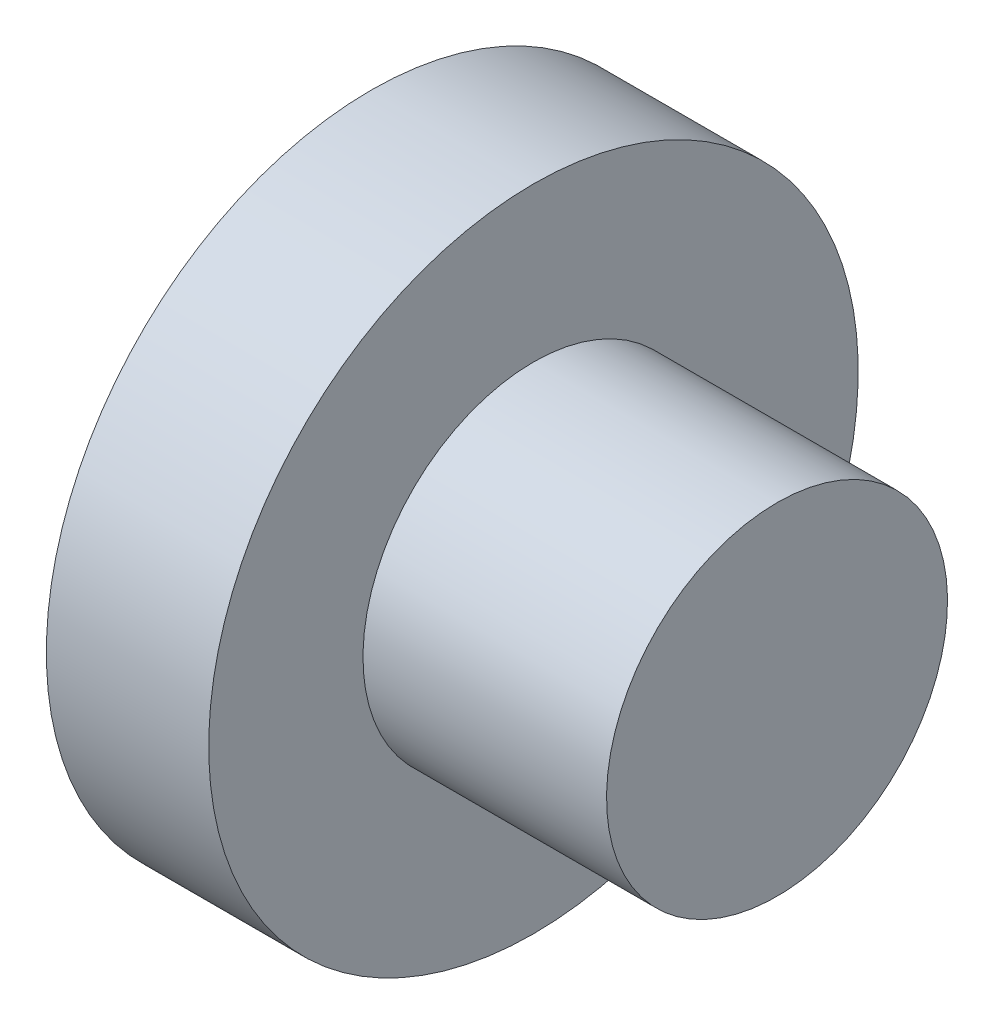
ISO-10303-21;
HEADER;
FILE_DESCRIPTION(('STEP AP214'),'2;1');
FILE_NAME('part.step','',(''),(''),'','','');
FILE_SCHEMA(('AUTOMOTIVE_DESIGN { 1 0 10303 214 1 1 1 1 }'));
ENDSEC;
DATA;
#1=APPLICATION_CONTEXT('core data for automotive mechanical design processes');
#2=APPLICATION_PROTOCOL_DEFINITION('international standard','automotive_design',2000,#1);
#3=PRODUCT_CONTEXT('',#1,'mechanical');
#4=PRODUCT('Part','Part','',(#3));
#5=PRODUCT_RELATED_PRODUCT_CATEGORY('part','',(#4));
#6=PRODUCT_DEFINITION_FORMATION('','',#4);
#7=PRODUCT_DEFINITION_CONTEXT('part definition',#1,'design');
#8=PRODUCT_DEFINITION('design','',#6,#7);
#9=PRODUCT_DEFINITION_SHAPE('','',#8);
#10=(LENGTH_UNIT() NAMED_UNIT(*) SI_UNIT(.MILLI.,.METRE.));
#11=(NAMED_UNIT(*) PLANE_ANGLE_UNIT() SI_UNIT($,.RADIAN.));
#12=(NAMED_UNIT(*) SI_UNIT($,.STERADIAN.) SOLID_ANGLE_UNIT());
#13=UNCERTAINTY_MEASURE_WITH_UNIT(LENGTH_MEASURE(1.E-05),#10,'distance_accuracy_value','');
#14=(GEOMETRIC_REPRESENTATION_CONTEXT(3) GLOBAL_UNCERTAINTY_ASSIGNED_CONTEXT((#13)) GLOBAL_UNIT_ASSIGNED_CONTEXT((#10,
#11,#12)) REPRESENTATION_CONTEXT('',''));
#15=CARTESIAN_POINT('',(0.,0.,0.));
#16=DIRECTION('',(0.,0.,1.));
#17=DIRECTION('',(1.,0.,0.));
#18=AXIS2_PLACEMENT_3D('',#15,#16,#17);
#19=CARTESIAN_POINT('',(2.,2.5,0.));
#20=DIRECTION('',(-1.,0.,0.));
#21=DIRECTION('',(0.,-1.,0.));
#22=AXIS2_PLACEMENT_3D('',#19,#20,#21);
#23=PLANE('',#22);
#24=CARTESIAN_POINT('',(2.,0.,0.));
#25=DIRECTION('',(1.,0.,0.));
#26=DIRECTION('',(0.,1.,0.));
#27=AXIS2_PLACEMENT_3D('',#24,#25,#26);
#28=CIRCLE('',#27,2.5);
#29=CARTESIAN_POINT('',(2.,2.5,0.));
#30=VERTEX_POINT('',#29);
#31=EDGE_CURVE('E18',#30,#30,#28,.F.);
#32=ORIENTED_EDGE('',*,*,#31,.T.);
#33=EDGE_LOOP('',(#32));
#34=FACE_BOUND('',#33,.T.);
#35=ADVANCED_FACE('F15',(#34),#23,.T.);
#36=CARTESIAN_POINT('',(1.5,0.,0.));
#37=DIRECTION('',(1.,0.,0.));
#38=DIRECTION('',(0.,1.,0.));
#39=AXIS2_PLACEMENT_3D('',#36,#37,#38);
#40=CYLINDRICAL_SURFACE('',#39,2.5);
#41=ORIENTED_EDGE('',*,*,#31,.F.);
#42=EDGE_LOOP('',(#41));
#43=FACE_BOUND('',#42,.T.);
#44=CARTESIAN_POINT('',(1.,0.,0.));
#45=DIRECTION('',(1.,0.,0.));
#46=DIRECTION('',(0.,1.,0.));
#47=AXIS2_PLACEMENT_3D('',#44,#45,#46);
#48=CIRCLE('',#47,2.5);
#49=CARTESIAN_POINT('',(1.,2.5,0.));
#50=VERTEX_POINT('',#49);
#51=EDGE_CURVE('E34',#50,#50,#48,.T.);
#52=ORIENTED_EDGE('',*,*,#51,.F.);
#53=EDGE_LOOP('',(#52));
#54=FACE_BOUND('',#53,.T.);
#55=ADVANCED_FACE('F42',(#43,#54),#40,.F.);
#56=CARTESIAN_POINT('',(6.,0.,0.));
#57=DIRECTION('',(1.,0.,0.));
#58=DIRECTION('',(0.,1.,0.));
#59=AXIS2_PLACEMENT_3D('',#56,#57,#58);
#60=PLANE('',#59);
#61=CARTESIAN_POINT('',(6.,0.,0.));
#62=DIRECTION('',(1.,0.,0.));
#63=DIRECTION('',(0.,1.,0.));
#64=AXIS2_PLACEMENT_3D('',#61,#62,#63);
#65=CIRCLE('',#64,2.1);
#66=CARTESIAN_POINT('',(6.,2.1,0.));
#67=VERTEX_POINT('',#66);
#68=EDGE_CURVE('E32',#67,#67,#65,.F.);
#69=ORIENTED_EDGE('',*,*,#68,.F.);
#70=EDGE_LOOP('',(#69));
#71=FACE_BOUND('',#70,.T.);
#72=ADVANCED_FACE('F45',(#71),#60,.T.);
#73=CARTESIAN_POINT('',(1.,4.,0.));
#74=DIRECTION('',(-1.,0.,0.));
#75=DIRECTION('',(0.,-1.,0.));
#76=AXIS2_PLACEMENT_3D('',#73,#74,#75);
#77=PLANE('',#76);
#78=CARTESIAN_POINT('',(1.,0.,0.));
#79=DIRECTION('',(1.,0.,0.));
#80=DIRECTION('',(0.,1.,0.));
#81=AXIS2_PLACEMENT_3D('',#78,#79,#80);
#82=CIRCLE('',#81,4.);
#83=CARTESIAN_POINT('',(1.,4.,0.));
#84=VERTEX_POINT('',#83);
#85=EDGE_CURVE('E27',#84,#84,#82,.T.);
#86=ORIENTED_EDGE('',*,*,#85,.F.);
#87=EDGE_LOOP('',(#86));
#88=FACE_BOUND('',#87,.T.);
#89=ORIENTED_EDGE('',*,*,#51,.T.);
#90=EDGE_LOOP('',(#89));
#91=FACE_BOUND('',#90,.T.);
#92=ADVANCED_FACE('F51',(#88,#91),#77,.T.);
#93=CARTESIAN_POINT('',(4.5,0.,0.));
#94=DIRECTION('',(1.,0.,0.));
#95=DIRECTION('',(0.,1.,0.));
#96=AXIS2_PLACEMENT_3D('',#93,#94,#95);
#97=CYLINDRICAL_SURFACE('',#96,2.1);
#98=ORIENTED_EDGE('',*,*,#68,.T.);
#99=EDGE_LOOP('',(#98));
#100=FACE_BOUND('',#99,.T.);
#101=CARTESIAN_POINT('',(3.,0.,0.));
#102=DIRECTION('',(1.,0.,0.));
#103=DIRECTION('',(0.,1.,0.));
#104=AXIS2_PLACEMENT_3D('',#101,#102,#103);
#105=CIRCLE('',#104,2.1);
#106=CARTESIAN_POINT('',(3.,2.1,0.));
#107=VERTEX_POINT('',#106);
#108=EDGE_CURVE('E22',#107,#107,#105,.F.);
#109=ORIENTED_EDGE('',*,*,#108,.F.);
#110=EDGE_LOOP('',(#109));
#111=FACE_BOUND('',#110,.T.);
#112=ADVANCED_FACE('F61',(#100,#111),#97,.T.);
#113=CARTESIAN_POINT('',(2.,0.,0.));
#114=DIRECTION('',(1.,0.,0.));
#115=DIRECTION('',(0.,1.,0.));
#116=AXIS2_PLACEMENT_3D('',#113,#114,#115);
#117=CYLINDRICAL_SURFACE('',#116,4.);
#118=CARTESIAN_POINT('',(3.,0.,0.));
#119=DIRECTION('',(1.,0.,0.));
#120=DIRECTION('',(0.,1.,0.));
#121=AXIS2_PLACEMENT_3D('',#118,#119,#120);
#122=CIRCLE('',#121,4.);
#123=CARTESIAN_POINT('',(3.,4.,0.));
#124=VERTEX_POINT('',#123);
#125=EDGE_CURVE('E10',#124,#124,#122,.T.);
#126=ORIENTED_EDGE('',*,*,#125,.F.);
#127=EDGE_LOOP('',(#126));
#128=FACE_BOUND('',#127,.T.);
#129=ORIENTED_EDGE('',*,*,#85,.T.);
#130=EDGE_LOOP('',(#129));
#131=FACE_BOUND('',#130,.T.);
#132=ADVANCED_FACE('F56',(#128,#131),#117,.T.);
#133=CARTESIAN_POINT('',(3.,2.1,0.));
#134=DIRECTION('',(1.,0.,0.));
#135=DIRECTION('',(0.,1.,0.));
#136=AXIS2_PLACEMENT_3D('',#133,#134,#135);
#137=PLANE('',#136);
#138=ORIENTED_EDGE('',*,*,#125,.T.);
#139=EDGE_LOOP('',(#138));
#140=FACE_BOUND('',#139,.T.);
#141=ORIENTED_EDGE('',*,*,#108,.T.);
#142=EDGE_LOOP('',(#141));
#143=FACE_BOUND('',#142,.T.);
#144=ADVANCED_FACE('F54',(#140,#143),#137,.T.);
#145=CLOSED_SHELL('',(#35,#55,#72,#92,#112,#132,#144));
#146=MANIFOLD_SOLID_BREP('B1',#145);
#147=ADVANCED_BREP_SHAPE_REPRESENTATION('',(#18,#146),#14);
#148=SHAPE_DEFINITION_REPRESENTATION(#9,#147);
ENDSEC;
END-ISO-10303-21;
